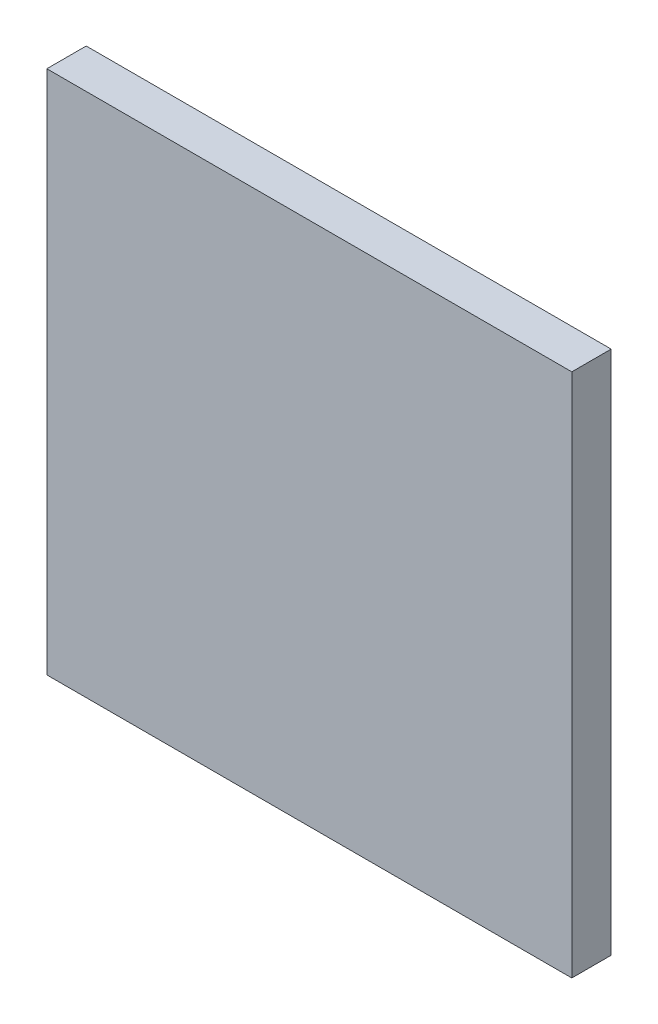
ISO-10303-21;
HEADER;
FILE_DESCRIPTION(('STEP AP214'),'2;1');
FILE_NAME('part.step','',(''),(''),'','','');
FILE_SCHEMA(('AUTOMOTIVE_DESIGN { 1 0 10303 214 1 1 1 1 }'));
ENDSEC;
DATA;
#1=APPLICATION_CONTEXT('core data for automotive mechanical design processes');
#2=APPLICATION_PROTOCOL_DEFINITION('international standard','automotive_design',2000,#1);
#3=PRODUCT_CONTEXT('',#1,'mechanical');
#4=PRODUCT('Part','Part','',(#3));
#5=PRODUCT_RELATED_PRODUCT_CATEGORY('part','',(#4));
#6=PRODUCT_DEFINITION_FORMATION('','',#4);
#7=PRODUCT_DEFINITION_CONTEXT('part definition',#1,'design');
#8=PRODUCT_DEFINITION('design','',#6,#7);
#9=PRODUCT_DEFINITION_SHAPE('','',#8);
#10=(LENGTH_UNIT() NAMED_UNIT(*) SI_UNIT(.MILLI.,.METRE.));
#11=(NAMED_UNIT(*) PLANE_ANGLE_UNIT() SI_UNIT($,.RADIAN.));
#12=(NAMED_UNIT(*) SI_UNIT($,.STERADIAN.) SOLID_ANGLE_UNIT());
#13=UNCERTAINTY_MEASURE_WITH_UNIT(LENGTH_MEASURE(1.E-05),#10,'distance_accuracy_value','');
#14=(GEOMETRIC_REPRESENTATION_CONTEXT(3) GLOBAL_UNCERTAINTY_ASSIGNED_CONTEXT((#13)) GLOBAL_UNIT_ASSIGNED_CONTEXT((#10,
#11,#12)) REPRESENTATION_CONTEXT('',''));
#15=CARTESIAN_POINT('',(0.,0.,0.));
#16=DIRECTION('',(0.,0.,1.));
#17=DIRECTION('',(1.,0.,0.));
#18=AXIS2_PLACEMENT_3D('',#15,#16,#17);
#19=CARTESIAN_POINT('',(20.,-20.,3.));
#20=DIRECTION('',(-1.,0.,0.));
#21=DIRECTION('',(0.,0.,1.));
#22=AXIS2_PLACEMENT_3D('',#19,#20,#21);
#23=PLANE('',#22);
#24=DIRECTION('',(0.,1.,0.));
#25=VECTOR('',#24,1.);
#26=CARTESIAN_POINT('',(20.,-20.,0.));
#27=LINE('',#26,#25);
#28=CARTESIAN_POINT('',(20.,-20.,0.));
#29=VERTEX_POINT('',#28);
#30=CARTESIAN_POINT('',(20.,20.,0.));
#31=VERTEX_POINT('',#30);
#32=EDGE_CURVE('E107',#29,#31,#27,.T.);
#33=ORIENTED_EDGE('',*,*,#32,.T.);
#34=DIRECTION('',(0.,0.,-1.));
#35=VECTOR('',#34,1.);
#36=CARTESIAN_POINT('',(20.,20.,3.));
#37=LINE('',#36,#35);
#38=CARTESIAN_POINT('',(20.,20.,3.));
#39=VERTEX_POINT('',#38);
#40=EDGE_CURVE('E11',#39,#31,#37,.T.);
#41=ORIENTED_EDGE('',*,*,#40,.F.);
#42=DIRECTION('',(0.,1.,0.));
#43=VECTOR('',#42,1.);
#44=CARTESIAN_POINT('',(20.,-20.,3.));
#45=LINE('',#44,#43);
#46=CARTESIAN_POINT('',(20.,-20.,3.));
#47=VERTEX_POINT('',#46);
#48=EDGE_CURVE('E91',#47,#39,#45,.T.);
#49=ORIENTED_EDGE('',*,*,#48,.F.);
#50=DIRECTION('',(0.,0.,-1.));
#51=VECTOR('',#50,1.);
#52=CARTESIAN_POINT('',(20.,-20.,3.));
#53=LINE('',#52,#51);
#54=EDGE_CURVE('E103',#47,#29,#53,.T.);
#55=ORIENTED_EDGE('',*,*,#54,.T.);
#56=EDGE_LOOP('',(#33,#41,#49,#55));
#57=FACE_BOUND('',#56,.T.);
#58=ADVANCED_FACE('F39',(#57),#23,.F.);
#59=CARTESIAN_POINT('',(-20.,20.,3.));
#60=DIRECTION('',(0.,-1.,0.));
#61=DIRECTION('',(0.,0.,-1.));
#62=AXIS2_PLACEMENT_3D('',#59,#60,#61);
#63=PLANE('',#62);
#64=DIRECTION('',(-1.,0.,0.));
#65=VECTOR('',#64,1.);
#66=CARTESIAN_POINT('',(-20.,20.,0.));
#67=LINE('',#66,#65);
#68=CARTESIAN_POINT('',(-20.,20.,0.));
#69=VERTEX_POINT('',#68);
#70=EDGE_CURVE('E96',#31,#69,#67,.T.);
#71=ORIENTED_EDGE('',*,*,#70,.T.);
#72=DIRECTION('',(0.,0.,-1.));
#73=VECTOR('',#72,1.);
#74=CARTESIAN_POINT('',(-20.,20.,3.));
#75=LINE('',#74,#73);
#76=CARTESIAN_POINT('',(-20.,20.,3.));
#77=VERTEX_POINT('',#76);
#78=EDGE_CURVE('E48',#77,#69,#75,.T.);
#79=ORIENTED_EDGE('',*,*,#78,.F.);
#80=DIRECTION('',(-1.,0.,0.));
#81=VECTOR('',#80,1.);
#82=CARTESIAN_POINT('',(-20.,20.,3.));
#83=LINE('',#82,#81);
#84=EDGE_CURVE('E86',#39,#77,#83,.T.);
#85=ORIENTED_EDGE('',*,*,#84,.F.);
#86=ORIENTED_EDGE('',*,*,#40,.T.);
#87=EDGE_LOOP('',(#71,#79,#85,#86));
#88=FACE_BOUND('',#87,.T.);
#89=ADVANCED_FACE('F95',(#88),#63,.F.);
#90=CARTESIAN_POINT('',(-20.,-20.,3.));
#91=DIRECTION('',(1.,0.,0.));
#92=DIRECTION('',(0.,0.,-1.));
#93=AXIS2_PLACEMENT_3D('',#90,#91,#92);
#94=PLANE('',#93);
#95=DIRECTION('',(0.,-1.,0.));
#96=VECTOR('',#95,1.);
#97=CARTESIAN_POINT('',(-20.,-20.,0.));
#98=LINE('',#97,#96);
#99=CARTESIAN_POINT('',(-20.,-20.,0.));
#100=VERTEX_POINT('',#99);
#101=EDGE_CURVE('E73',#69,#100,#98,.T.);
#102=ORIENTED_EDGE('',*,*,#101,.T.);
#103=DIRECTION('',(0.,0.,-1.));
#104=VECTOR('',#103,1.);
#105=CARTESIAN_POINT('',(-20.,-20.,3.));
#106=LINE('',#105,#104);
#107=CARTESIAN_POINT('',(-20.,-20.,3.));
#108=VERTEX_POINT('',#107);
#109=EDGE_CURVE('E98',#108,#100,#106,.T.);
#110=ORIENTED_EDGE('',*,*,#109,.F.);
#111=DIRECTION('',(0.,-1.,0.));
#112=VECTOR('',#111,1.);
#113=CARTESIAN_POINT('',(-20.,-20.,3.));
#114=LINE('',#113,#112);
#115=EDGE_CURVE('E89',#77,#108,#114,.T.);
#116=ORIENTED_EDGE('',*,*,#115,.F.);
#117=ORIENTED_EDGE('',*,*,#78,.T.);
#118=EDGE_LOOP('',(#102,#110,#116,#117));
#119=FACE_BOUND('',#118,.T.);
#120=ADVANCED_FACE('F99',(#119),#94,.F.);
#121=CARTESIAN_POINT('',(-20.,-20.,3.));
#122=DIRECTION('',(0.,1.,0.));
#123=DIRECTION('',(0.,0.,1.));
#124=AXIS2_PLACEMENT_3D('',#121,#122,#123);
#125=PLANE('',#124);
#126=DIRECTION('',(1.,0.,0.));
#127=VECTOR('',#126,1.);
#128=CARTESIAN_POINT('',(-20.,-20.,0.));
#129=LINE('',#128,#127);
#130=EDGE_CURVE('E79',#100,#29,#129,.T.);
#131=ORIENTED_EDGE('',*,*,#130,.T.);
#132=ORIENTED_EDGE('',*,*,#54,.F.);
#133=DIRECTION('',(1.,0.,0.));
#134=VECTOR('',#133,1.);
#135=CARTESIAN_POINT('',(-20.,-20.,3.));
#136=LINE('',#135,#134);
#137=EDGE_CURVE('E56',#108,#47,#136,.T.);
#138=ORIENTED_EDGE('',*,*,#137,.F.);
#139=ORIENTED_EDGE('',*,*,#109,.T.);
#140=EDGE_LOOP('',(#131,#132,#138,#139));
#141=FACE_BOUND('',#140,.T.);
#142=ADVANCED_FACE('F120',(#141),#125,.F.);
#143=CARTESIAN_POINT('',(0.,0.,3.));
#144=DIRECTION('',(0.,0.,-1.));
#145=DIRECTION('',(-1.,0.,0.));
#146=AXIS2_PLACEMENT_3D('',#143,#144,#145);
#147=PLANE('',#146);
#148=ORIENTED_EDGE('',*,*,#48,.T.);
#149=ORIENTED_EDGE('',*,*,#84,.T.);
#150=ORIENTED_EDGE('',*,*,#115,.T.);
#151=ORIENTED_EDGE('',*,*,#137,.T.);
#152=EDGE_LOOP('',(#148,#149,#150,#151));
#153=FACE_BOUND('',#152,.T.);
#154=ADVANCED_FACE('F87',(#153),#147,.F.);
#155=CARTESIAN_POINT('',(0.,0.,0.));
#156=DIRECTION('',(0.,0.,-1.));
#157=DIRECTION('',(-1.,0.,0.));
#158=AXIS2_PLACEMENT_3D('',#155,#156,#157);
#159=PLANE('',#158);
#160=ORIENTED_EDGE('',*,*,#32,.F.);
#161=ORIENTED_EDGE('',*,*,#130,.F.);
#162=ORIENTED_EDGE('',*,*,#101,.F.);
#163=ORIENTED_EDGE('',*,*,#70,.F.);
#164=EDGE_LOOP('',(#160,#161,#162,#163));
#165=FACE_BOUND('',#164,.T.);
#166=ADVANCED_FACE('F123',(#165),#159,.T.);
#167=CLOSED_SHELL('',(#58,#89,#120,#142,#154,#166));
#168=MANIFOLD_SOLID_BREP('B2',#167);
#169=ADVANCED_BREP_SHAPE_REPRESENTATION('',(#18,#168),#14);
#170=SHAPE_DEFINITION_REPRESENTATION(#9,#169);
ENDSEC;
END-ISO-10303-21;
